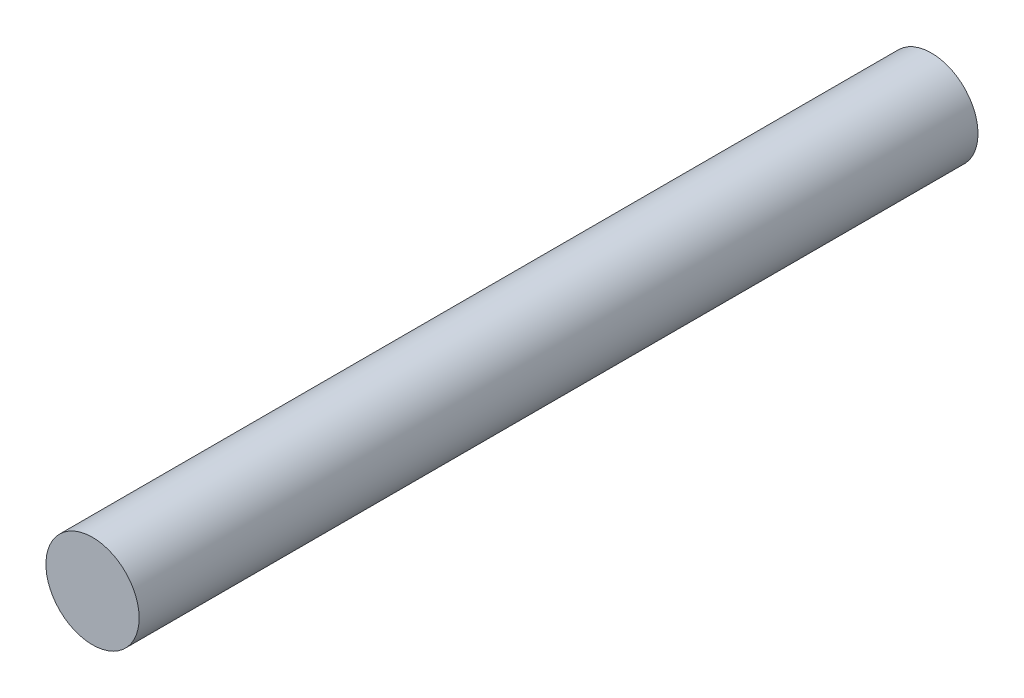
ISO-10303-21;
HEADER;
FILE_DESCRIPTION(('STEP AP214'),'2;1');
FILE_NAME('part.step','',(''),(''),'','','');
FILE_SCHEMA(('AUTOMOTIVE_DESIGN { 1 0 10303 214 1 1 1 1 }'));
ENDSEC;
DATA;
#1=APPLICATION_CONTEXT('core data for automotive mechanical design processes');
#2=APPLICATION_PROTOCOL_DEFINITION('international standard','automotive_design',2000,#1);
#3=PRODUCT_CONTEXT('',#1,'mechanical');
#4=PRODUCT('Part','Part','',(#3));
#5=PRODUCT_RELATED_PRODUCT_CATEGORY('part','',(#4));
#6=PRODUCT_DEFINITION_FORMATION('','',#4);
#7=PRODUCT_DEFINITION_CONTEXT('part definition',#1,'design');
#8=PRODUCT_DEFINITION('design','',#6,#7);
#9=PRODUCT_DEFINITION_SHAPE('','',#8);
#10=(LENGTH_UNIT() NAMED_UNIT(*) SI_UNIT(.MILLI.,.METRE.));
#11=(NAMED_UNIT(*) PLANE_ANGLE_UNIT() SI_UNIT($,.RADIAN.));
#12=(NAMED_UNIT(*) SI_UNIT($,.STERADIAN.) SOLID_ANGLE_UNIT());
#13=UNCERTAINTY_MEASURE_WITH_UNIT(LENGTH_MEASURE(1.E-05),#10,'distance_accuracy_value','');
#14=(GEOMETRIC_REPRESENTATION_CONTEXT(3) GLOBAL_UNCERTAINTY_ASSIGNED_CONTEXT((#13)) GLOBAL_UNIT_ASSIGNED_CONTEXT((#10,
#11,#12)) REPRESENTATION_CONTEXT('',''));
#15=CARTESIAN_POINT('',(0.,0.,0.));
#16=DIRECTION('',(0.,0.,1.));
#17=DIRECTION('',(1.,0.,0.));
#18=AXIS2_PLACEMENT_3D('',#15,#16,#17);
#19=CARTESIAN_POINT('',(6.426,3.899,-9.1));
#20=DIRECTION('',(0.,0.,-1.));
#21=DIRECTION('',(-1.,0.,0.));
#22=AXIS2_PLACEMENT_3D('',#19,#20,#21);
#23=PLANE('',#22);
#24=CARTESIAN_POINT('',(6.125,4.2,-9.1));
#25=DIRECTION('',(0.,0.,1.));
#26=DIRECTION('',(1.,0.,0.));
#27=AXIS2_PLACEMENT_3D('',#24,#25,#26);
#28=CIRCLE('',#27,0.3);
#29=CARTESIAN_POINT('',(6.425,4.2,-9.1));
#30=VERTEX_POINT('',#29);
#31=EDGE_CURVE('E19',#30,#30,#28,.T.);
#32=ORIENTED_EDGE('',*,*,#31,.F.);
#33=EDGE_LOOP('',(#32));
#34=FACE_BOUND('',#33,.T.);
#35=ADVANCED_FACE('F15',(#34),#23,.T.);
#36=CARTESIAN_POINT('',(6.125,4.2,-9.1));
#37=DIRECTION('',(0.,0.,1.));
#38=DIRECTION('',(1.,0.,0.));
#39=AXIS2_PLACEMENT_3D('',#36,#37,#38);
#40=CYLINDRICAL_SURFACE('',#39,0.3);
#41=CARTESIAN_POINT('',(6.125,4.2,-3.7));
#42=DIRECTION('',(0.,0.,1.));
#43=DIRECTION('',(1.,0.,0.));
#44=AXIS2_PLACEMENT_3D('',#41,#42,#43);
#45=CIRCLE('',#44,0.3);
#46=CARTESIAN_POINT('',(6.425,4.2,-3.7));
#47=VERTEX_POINT('',#46);
#48=EDGE_CURVE('E10',#47,#47,#45,.T.);
#49=ORIENTED_EDGE('',*,*,#48,.F.);
#50=EDGE_LOOP('',(#49));
#51=FACE_BOUND('',#50,.T.);
#52=ORIENTED_EDGE('',*,*,#31,.T.);
#53=EDGE_LOOP('',(#52));
#54=FACE_BOUND('',#53,.T.);
#55=ADVANCED_FACE('F28',(#51,#54),#40,.T.);
#56=CARTESIAN_POINT('',(6.426,4.501,-3.7));
#57=DIRECTION('',(0.,0.,1.));
#58=DIRECTION('',(-1.,0.,0.));
#59=AXIS2_PLACEMENT_3D('',#56,#57,#58);
#60=PLANE('',#59);
#61=ORIENTED_EDGE('',*,*,#48,.T.);
#62=EDGE_LOOP('',(#61));
#63=FACE_BOUND('',#62,.T.);
#64=ADVANCED_FACE('F17',(#63),#60,.T.);
#65=CLOSED_SHELL('',(#35,#55,#64));
#66=MANIFOLD_SOLID_BREP('B1',#65);
#67=ADVANCED_BREP_SHAPE_REPRESENTATION('',(#18,#66),#14);
#68=SHAPE_DEFINITION_REPRESENTATION(#9,#67);
ENDSEC;
END-ISO-10303-21;
